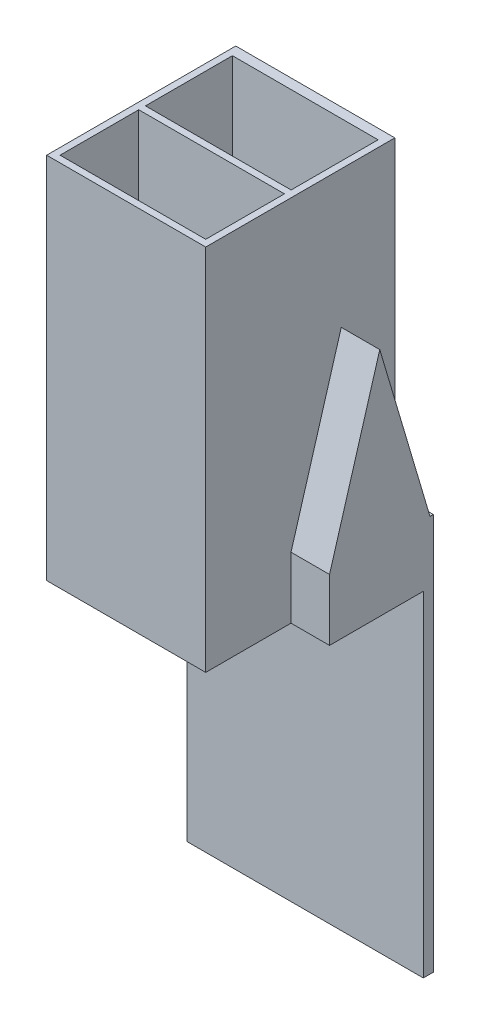
ISO-10303-21;
HEADER;
FILE_DESCRIPTION(('STEP AP214'),'2;1');
FILE_NAME('part.step','',(''),(''),'','','');
FILE_SCHEMA(('AUTOMOTIVE_DESIGN { 1 0 10303 214 1 1 1 1 }'));
ENDSEC;
DATA;
#1=APPLICATION_CONTEXT('core data for automotive mechanical design processes');
#2=APPLICATION_PROTOCOL_DEFINITION('international standard','automotive_design',2000,#1);
#3=PRODUCT_CONTEXT('',#1,'mechanical');
#4=PRODUCT('Part','Part','',(#3));
#5=PRODUCT_RELATED_PRODUCT_CATEGORY('part','',(#4));
#6=PRODUCT_DEFINITION_FORMATION('','',#4);
#7=PRODUCT_DEFINITION_CONTEXT('part definition',#1,'design');
#8=PRODUCT_DEFINITION('design','',#6,#7);
#9=PRODUCT_DEFINITION_SHAPE('','',#8);
#10=(LENGTH_UNIT() NAMED_UNIT(*) SI_UNIT(.MILLI.,.METRE.));
#11=(NAMED_UNIT(*) PLANE_ANGLE_UNIT() SI_UNIT($,.RADIAN.));
#12=(NAMED_UNIT(*) SI_UNIT($,.STERADIAN.) SOLID_ANGLE_UNIT());
#13=UNCERTAINTY_MEASURE_WITH_UNIT(LENGTH_MEASURE(1.E-05),#10,'distance_accuracy_value','');
#14=(GEOMETRIC_REPRESENTATION_CONTEXT(3) GLOBAL_UNCERTAINTY_ASSIGNED_CONTEXT((#13)) GLOBAL_UNIT_ASSIGNED_CONTEXT((#10,
#11,#12)) REPRESENTATION_CONTEXT('',''));
#15=CARTESIAN_POINT('',(0.,0.,0.));
#16=DIRECTION('',(0.,0.,1.));
#17=DIRECTION('',(1.,0.,0.));
#18=AXIS2_PLACEMENT_3D('',#15,#16,#17);
#19=CARTESIAN_POINT('',(0.399999999999999,22.,-5.5));
#20=DIRECTION('',(1.,0.,0.));
#21=DIRECTION('',(0.,0.,-1.));
#22=AXIS2_PLACEMENT_3D('',#19,#20,#21);
#23=PLANE('',#22);
#24=DIRECTION('',(0.,0.958836299508465,0.283959417426001));
#25=VECTOR('',#24,1.);
#26=CARTESIAN_POINT('',(0.399999999999999,21.931223694982,-5.26776534338938));
#27=LINE('',#26,#25);
#28=CARTESIAN_POINT('',(0.399999999999999,3.61201467116017,-10.693));
#29=VERTEX_POINT('',#28);
#30=CARTESIAN_POINT('',(0.399999999999999,12.3913480044935,-8.093));
#31=VERTEX_POINT('',#30);
#32=EDGE_CURVE('E424',#29,#31,#27,.T.);
#33=ORIENTED_EDGE('',*,*,#32,.F.);
#34=DIRECTION('',(0.,-1.,0.));
#35=VECTOR('',#34,1.);
#36=CARTESIAN_POINT('',(0.4,22.,-10.693));
#37=LINE('',#36,#35);
#38=CARTESIAN_POINT('',(0.4,22.,-10.693));
#39=VERTEX_POINT('',#38);
#40=EDGE_CURVE('E521',#39,#29,#37,.T.);
#41=ORIENTED_EDGE('',*,*,#40,.F.);
#42=DIRECTION('',(0.,0.,1.));
#43=VECTOR('',#42,1.);
#44=CARTESIAN_POINT('',(0.399999999999999,22.,-5.5));
#45=LINE('',#44,#43);
#46=CARTESIAN_POINT('',(0.399999999999999,22.,-5.5));
#47=VERTEX_POINT('',#46);
#48=EDGE_CURVE('E508',#39,#47,#45,.T.);
#49=ORIENTED_EDGE('',*,*,#48,.T.);
#50=DIRECTION('',(0.,-1.,0.));
#51=VECTOR('',#50,1.);
#52=CARTESIAN_POINT('',(0.399999999999999,22.,-5.5));
#53=LINE('',#52,#51);
#54=CARTESIAN_POINT('',(0.399999999999999,3.63565133782683,-5.5));
#55=VERTEX_POINT('',#54);
#56=EDGE_CURVE('E535',#47,#55,#53,.T.);
#57=ORIENTED_EDGE('',*,*,#56,.T.);
#58=DIRECTION('',(0.,-0.958836299508465,0.283959417426001));
#59=VECTOR('',#58,1.);
#60=CARTESIAN_POINT('',(0.4,20.5192283788606,-10.5000721740475));
#61=LINE('',#60,#59);
#62=EDGE_CURVE('E418',#31,#55,#61,.T.);
#63=ORIENTED_EDGE('',*,*,#62,.F.);
#64=EDGE_LOOP('',(#33,#41,#49,#57,#63));
#65=FACE_BOUND('',#64,.T.);
#66=ADVANCED_FACE('F39',(#65),#23,.T.);
#67=CARTESIAN_POINT('',(9.1,22.,-5.5));
#68=DIRECTION('',(0.,0.,-1.));
#69=DIRECTION('',(-1.,0.,0.));
#70=AXIS2_PLACEMENT_3D('',#67,#68,#69);
#71=PLANE('',#70);
#72=DIRECTION('',(1.,0.,0.));
#73=VECTOR('',#72,1.);
#74=CARTESIAN_POINT('',(9.10000000000001,3.63565133782683,-5.5));
#75=LINE('',#74,#73);
#76=CARTESIAN_POINT('',(9.1,3.63565133782684,-5.5));
#77=VERTEX_POINT('',#76);
#78=EDGE_CURVE('E415',#55,#77,#75,.T.);
#79=ORIENTED_EDGE('',*,*,#78,.F.);
#80=ORIENTED_EDGE('',*,*,#56,.F.);
#81=DIRECTION('',(1.,0.,0.));
#82=VECTOR('',#81,1.);
#83=CARTESIAN_POINT('',(9.1,22.,-5.5));
#84=LINE('',#83,#82);
#85=CARTESIAN_POINT('',(9.1,22.,-5.5));
#86=VERTEX_POINT('',#85);
#87=EDGE_CURVE('E511',#47,#86,#84,.T.);
#88=ORIENTED_EDGE('',*,*,#87,.T.);
#89=DIRECTION('',(0.,-1.,0.));
#90=VECTOR('',#89,1.);
#91=CARTESIAN_POINT('',(9.1,22.,-5.5));
#92=LINE('',#91,#90);
#93=EDGE_CURVE('E531',#86,#77,#92,.T.);
#94=ORIENTED_EDGE('',*,*,#93,.T.);
#95=EDGE_LOOP('',(#79,#80,#88,#94));
#96=FACE_BOUND('',#95,.T.);
#97=ADVANCED_FACE('F720',(#96),#71,.T.);
#98=CARTESIAN_POINT('',(9.1,22.,-5.5));
#99=DIRECTION('',(-1.,0.,0.));
#100=DIRECTION('',(0.,0.,1.));
#101=AXIS2_PLACEMENT_3D('',#98,#99,#100);
#102=PLANE('',#101);
#103=DIRECTION('',(0.,-0.958836299508465,-0.283959417426001));
#104=VECTOR('',#103,1.);
#105=CARTESIAN_POINT('',(9.1,21.931223694982,-5.26776534338938));
#106=LINE('',#105,#104);
#107=CARTESIAN_POINT('',(9.1,12.3913480044935,-8.093));
#108=VERTEX_POINT('',#107);
#109=CARTESIAN_POINT('',(9.1,3.61201467116017,-10.693));
#110=VERTEX_POINT('',#109);
#111=EDGE_CURVE('E421',#108,#110,#106,.T.);
#112=ORIENTED_EDGE('',*,*,#111,.F.);
#113=DIRECTION('',(0.,0.958836299508465,-0.283959417426001));
#114=VECTOR('',#113,1.);
#115=CARTESIAN_POINT('',(9.1,20.5192283788606,-10.5000721740475));
#116=LINE('',#115,#114);
#117=EDGE_CURVE('E412',#77,#108,#116,.T.);
#118=ORIENTED_EDGE('',*,*,#117,.F.);
#119=ORIENTED_EDGE('',*,*,#93,.F.);
#120=DIRECTION('',(0.,0.,-1.));
#121=VECTOR('',#120,1.);
#122=CARTESIAN_POINT('',(9.1,22.,-5.5));
#123=LINE('',#122,#121);
#124=CARTESIAN_POINT('',(9.1,22.,-10.693));
#125=VERTEX_POINT('',#124);
#126=EDGE_CURVE('E514',#86,#125,#123,.T.);
#127=ORIENTED_EDGE('',*,*,#126,.T.);
#128=DIRECTION('',(0.,-1.,0.));
#129=VECTOR('',#128,1.);
#130=CARTESIAN_POINT('',(9.1,22.,-10.693));
#131=LINE('',#130,#129);
#132=EDGE_CURVE('E527',#125,#110,#131,.T.);
#133=ORIENTED_EDGE('',*,*,#132,.T.);
#134=EDGE_LOOP('',(#112,#118,#119,#127,#133));
#135=FACE_BOUND('',#134,.T.);
#136=ADVANCED_FACE('F675',(#135),#102,.T.);
#137=CARTESIAN_POINT('',(0.,22.,0.));
#138=DIRECTION('',(1.,0.,0.));
#139=DIRECTION('',(0.,0.,-1.));
#140=AXIS2_PLACEMENT_3D('',#137,#138,#139);
#141=PLANE('',#140);
#142=DIRECTION('',(0.,-0.958836299508464,-0.283959417426001));
#143=VECTOR('',#142,1.);
#144=CARTESIAN_POINT('',(0.,3.67,-11.093));
#145=LINE('',#144,#143);
#146=CARTESIAN_POINT('',(0.,13.8,-8.093));
#147=VERTEX_POINT('',#146);
#148=CARTESIAN_POINT('',(0.,3.66999999999995,-11.093));
#149=VERTEX_POINT('',#148);
#150=EDGE_CURVE('E472',#147,#149,#145,.T.);
#151=ORIENTED_EDGE('',*,*,#150,.F.);
#152=DIRECTION('',(0.,0.958836299508464,-0.283959417426001));
#153=VECTOR('',#152,1.);
#154=CARTESIAN_POINT('',(0.,13.8,-8.093));
#155=LINE('',#154,#153);
#156=CARTESIAN_POINT('',(0.,3.67,-5.093));
#157=VERTEX_POINT('',#156);
#158=EDGE_CURVE('E486',#157,#147,#155,.T.);
#159=ORIENTED_EDGE('',*,*,#158,.F.);
#160=DIRECTION('',(0.,1.,0.));
#161=VECTOR('',#160,1.);
#162=CARTESIAN_POINT('',(0.,3.67,-5.093));
#163=LINE('',#162,#161);
#164=CARTESIAN_POINT('',(0.,0.,-5.093));
#165=VERTEX_POINT('',#164);
#166=EDGE_CURVE('E467',#165,#157,#163,.T.);
#167=ORIENTED_EDGE('',*,*,#166,.F.);
#168=DIRECTION('',(0.,0.,1.));
#169=VECTOR('',#168,1.);
#170=CARTESIAN_POINT('',(0.,0.,0.));
#171=LINE('',#170,#169);
#172=CARTESIAN_POINT('',(0.,0.,0.));
#173=VERTEX_POINT('',#172);
#174=EDGE_CURVE('E582',#165,#173,#171,.T.);
#175=ORIENTED_EDGE('',*,*,#174,.T.);
#176=DIRECTION('',(0.,-1.,0.));
#177=VECTOR('',#176,1.);
#178=CARTESIAN_POINT('',(0.,22.,0.));
#179=LINE('',#178,#177);
#180=CARTESIAN_POINT('',(0.,22.,0.));
#181=VERTEX_POINT('',#180);
#182=EDGE_CURVE('E43',#181,#173,#179,.T.);
#183=ORIENTED_EDGE('',*,*,#182,.F.);
#184=DIRECTION('',(0.,0.,1.));
#185=VECTOR('',#184,1.);
#186=CARTESIAN_POINT('',(0.,22.,0.));
#187=LINE('',#186,#185);
#188=CARTESIAN_POINT('',(0.,22.,-11.293));
#189=VERTEX_POINT('',#188);
#190=EDGE_CURVE('E583',#189,#181,#187,.T.);
#191=ORIENTED_EDGE('',*,*,#190,.F.);
#192=DIRECTION('',(0.,1.,0.));
#193=VECTOR('',#192,1.);
#194=CARTESIAN_POINT('',(0.,22.,-11.293));
#195=LINE('',#194,#193);
#196=CARTESIAN_POINT('',(0.,3.66999999999995,-11.293));
#197=VERTEX_POINT('',#196);
#198=EDGE_CURVE('E293',#197,#189,#195,.T.);
#199=ORIENTED_EDGE('',*,*,#198,.F.);
#200=DIRECTION('',(0.,0.,1.));
#201=VECTOR('',#200,1.);
#202=CARTESIAN_POINT('',(0.,3.66999999999995,-11.293));
#203=LINE('',#202,#201);
#204=EDGE_CURVE('E312',#197,#149,#203,.T.);
#205=ORIENTED_EDGE('',*,*,#204,.T.);
#206=EDGE_LOOP('',(#151,#159,#167,#175,#183,#191,#199,#205));
#207=FACE_BOUND('',#206,.T.);
#208=ADVANCED_FACE('F41',(#207),#141,.F.);
#209=CARTESIAN_POINT('',(0.,22.,0.));
#210=DIRECTION('',(0.,-1.,0.));
#211=DIRECTION('',(0.,0.,-1.));
#212=AXIS2_PLACEMENT_3D('',#209,#210,#211);
#213=PLANE('',#212);
#214=DIRECTION('',(1.,0.,0.));
#215=VECTOR('',#214,1.);
#216=CARTESIAN_POINT('',(0.4,22.,-0.4));
#217=LINE('',#216,#215);
#218=CARTESIAN_POINT('',(0.4,22.,-0.4));
#219=VERTEX_POINT('',#218);
#220=CARTESIAN_POINT('',(9.1,22.,-0.4));
#221=VERTEX_POINT('',#220);
#222=EDGE_CURVE('E540',#219,#221,#217,.T.);
#223=ORIENTED_EDGE('',*,*,#222,.F.);
#224=DIRECTION('',(0.,0.,1.));
#225=VECTOR('',#224,1.);
#226=CARTESIAN_POINT('',(0.4,22.,-0.4));
#227=LINE('',#226,#225);
#228=CARTESIAN_POINT('',(0.4,22.,-5.1));
#229=VERTEX_POINT('',#228);
#230=EDGE_CURVE('E551',#229,#219,#227,.T.);
#231=ORIENTED_EDGE('',*,*,#230,.F.);
#232=DIRECTION('',(-1.,0.,0.));
#233=VECTOR('',#232,1.);
#234=CARTESIAN_POINT('',(0.4,22.,-5.1));
#235=LINE('',#234,#233);
#236=CARTESIAN_POINT('',(9.1,22.,-5.1));
#237=VERTEX_POINT('',#236);
#238=EDGE_CURVE('E547',#237,#229,#235,.T.);
#239=ORIENTED_EDGE('',*,*,#238,.F.);
#240=DIRECTION('',(0.,0.,-1.));
#241=VECTOR('',#240,1.);
#242=CARTESIAN_POINT('',(9.1,22.,-0.4));
#243=LINE('',#242,#241);
#244=EDGE_CURVE('E543',#221,#237,#243,.T.);
#245=ORIENTED_EDGE('',*,*,#244,.F.);
#246=EDGE_LOOP('',(#223,#231,#239,#245));
#247=FACE_BOUND('',#246,.T.);
#248=ORIENTED_EDGE('',*,*,#190,.T.);
#249=DIRECTION('',(1.,0.,0.));
#250=VECTOR('',#249,1.);
#251=CARTESIAN_POINT('',(0.,22.,0.));
#252=LINE('',#251,#250);
#253=CARTESIAN_POINT('',(9.5,22.,0.));
#254=VERTEX_POINT('',#253);
#255=EDGE_CURVE('E587',#181,#254,#252,.T.);
#256=ORIENTED_EDGE('',*,*,#255,.T.);
#257=DIRECTION('',(0.,0.,-1.));
#258=VECTOR('',#257,1.);
#259=CARTESIAN_POINT('',(9.5,22.,0.));
#260=LINE('',#259,#258);
#261=CARTESIAN_POINT('',(9.5,22.,-11.293));
#262=VERTEX_POINT('',#261);
#263=EDGE_CURVE('E591',#254,#262,#260,.T.);
#264=ORIENTED_EDGE('',*,*,#263,.T.);
#265=DIRECTION('',(1.,0.,0.));
#266=VECTOR('',#265,1.);
#267=CARTESIAN_POINT('',(9.5,22.,-11.293));
#268=LINE('',#267,#266);
#269=EDGE_CURVE('E297',#189,#262,#268,.T.);
#270=ORIENTED_EDGE('',*,*,#269,.F.);
#271=EDGE_LOOP('',(#248,#256,#264,#270));
#272=FACE_BOUND('',#271,.T.);
#273=ORIENTED_EDGE('',*,*,#48,.F.);
#274=DIRECTION('',(-1.,0.,0.));
#275=VECTOR('',#274,1.);
#276=CARTESIAN_POINT('',(0.4,22.,-10.693));
#277=LINE('',#276,#275);
#278=EDGE_CURVE('E518',#125,#39,#277,.T.);
#279=ORIENTED_EDGE('',*,*,#278,.F.);
#280=ORIENTED_EDGE('',*,*,#126,.F.);
#281=ORIENTED_EDGE('',*,*,#87,.F.);
#282=EDGE_LOOP('',(#273,#279,#280,#281));
#283=FACE_BOUND('',#282,.T.);
#284=ADVANCED_FACE('F683',(#247,#272,#283),#213,.F.);
#285=CARTESIAN_POINT('',(0.,0.,0.));
#286=DIRECTION('',(0.,-1.,0.));
#287=DIRECTION('',(0.,0.,-1.));
#288=AXIS2_PLACEMENT_3D('',#285,#286,#287);
#289=PLANE('',#288);
#290=DIRECTION('',(-1.,0.,0.));
#291=VECTOR('',#290,1.);
#292=CARTESIAN_POINT('',(-2.3,0.,-10.693));
#293=LINE('',#292,#291);
#294=CARTESIAN_POINT('',(11.8,0.,-10.693));
#295=VERTEX_POINT('',#294);
#296=CARTESIAN_POINT('',(11.4,0.,-10.693));
#297=VERTEX_POINT('',#296);
#298=EDGE_CURVE('E50',#295,#297,#293,.T.);
#299=ORIENTED_EDGE('',*,*,#298,.F.);
#300=DIRECTION('',(0.,0.,1.));
#301=VECTOR('',#300,1.);
#302=CARTESIAN_POINT('',(11.8,0.,-5.093));
#303=LINE('',#302,#301);
#304=CARTESIAN_POINT('',(11.8,0.,-5.093));
#305=VERTEX_POINT('',#304);
#306=EDGE_CURVE('E428',#295,#305,#303,.T.);
#307=ORIENTED_EDGE('',*,*,#306,.T.);
#308=DIRECTION('',(-1.,0.,0.));
#309=VECTOR('',#308,1.);
#310=CARTESIAN_POINT('',(11.8,0.,-5.093));
#311=LINE('',#310,#309);
#312=CARTESIAN_POINT('',(9.5,0.,-5.093));
#313=VERTEX_POINT('',#312);
#314=EDGE_CURVE('E444',#305,#313,#311,.T.);
#315=ORIENTED_EDGE('',*,*,#314,.T.);
#316=DIRECTION('',(0.,0.,-1.));
#317=VECTOR('',#316,1.);
#318=CARTESIAN_POINT('',(9.5,0.,0.));
#319=LINE('',#318,#317);
#320=CARTESIAN_POINT('',(9.5,0.,0.));
#321=VERTEX_POINT('',#320);
#322=EDGE_CURVE('E588',#321,#313,#319,.T.);
#323=ORIENTED_EDGE('',*,*,#322,.F.);
#324=DIRECTION('',(1.,0.,0.));
#325=VECTOR('',#324,1.);
#326=CARTESIAN_POINT('',(0.,0.,0.));
#327=LINE('',#326,#325);
#328=EDGE_CURVE('E597',#173,#321,#327,.T.);
#329=ORIENTED_EDGE('',*,*,#328,.F.);
#330=ORIENTED_EDGE('',*,*,#174,.F.);
#331=DIRECTION('',(1.,0.,0.));
#332=VECTOR('',#331,1.);
#333=CARTESIAN_POINT('',(-2.3,0.,-5.093));
#334=LINE('',#333,#332);
#335=CARTESIAN_POINT('',(-2.3,0.,-5.093));
#336=VERTEX_POINT('',#335);
#337=EDGE_CURVE('E503',#336,#165,#334,.T.);
#338=ORIENTED_EDGE('',*,*,#337,.F.);
#339=DIRECTION('',(0.,0.,1.));
#340=VECTOR('',#339,1.);
#341=CARTESIAN_POINT('',(-2.3,0.,-5.093));
#342=LINE('',#341,#340);
#343=CARTESIAN_POINT('',(-2.3,0.,-10.693));
#344=VERTEX_POINT('',#343);
#345=EDGE_CURVE('E468',#344,#336,#342,.T.);
#346=ORIENTED_EDGE('',*,*,#345,.F.);
#347=CARTESIAN_POINT('',(-1.9,0.,-10.693));
#348=VERTEX_POINT('',#347);
#349=EDGE_CURVE('E11',#348,#344,#293,.T.);
#350=ORIENTED_EDGE('',*,*,#349,.F.);
#351=DIRECTION('',(0.,0.,-1.));
#352=VECTOR('',#351,1.);
#353=CARTESIAN_POINT('',(-1.9,0.,-5.5));
#354=LINE('',#353,#352);
#355=CARTESIAN_POINT('',(-1.9,0.,-5.5));
#356=VERTEX_POINT('',#355);
#357=EDGE_CURVE('E330',#356,#348,#354,.T.);
#358=ORIENTED_EDGE('',*,*,#357,.F.);
#359=DIRECTION('',(1.,0.,0.));
#360=VECTOR('',#359,1.);
#361=CARTESIAN_POINT('',(9.1,0.,-5.5));
#362=LINE('',#361,#360);
#363=CARTESIAN_POINT('',(11.4,0.,-5.5));
#364=VERTEX_POINT('',#363);
#365=EDGE_CURVE('E507',#356,#364,#362,.T.);
#366=ORIENTED_EDGE('',*,*,#365,.T.);
#367=DIRECTION('',(0.,0.,1.));
#368=VECTOR('',#367,1.);
#369=CARTESIAN_POINT('',(11.4,0.,-5.5));
#370=LINE('',#369,#368);
#371=EDGE_CURVE('E336',#297,#364,#370,.T.);
#372=ORIENTED_EDGE('',*,*,#371,.F.);
#373=EDGE_LOOP('',(#299,#307,#315,#323,#329,#330,#338,#346,#350,#358,#366,#372));
#374=FACE_BOUND('',#373,.T.);
#375=DIRECTION('',(0.,0.,1.));
#376=VECTOR('',#375,1.);
#377=CARTESIAN_POINT('',(0.4,0.,-0.4));
#378=LINE('',#377,#376);
#379=CARTESIAN_POINT('',(0.4,0.,-5.1));
#380=VERTEX_POINT('',#379);
#381=CARTESIAN_POINT('',(0.4,0.,-0.4));
#382=VERTEX_POINT('',#381);
#383=EDGE_CURVE('E544',#380,#382,#378,.T.);
#384=ORIENTED_EDGE('',*,*,#383,.T.);
#385=DIRECTION('',(1.,0.,0.));
#386=VECTOR('',#385,1.);
#387=CARTESIAN_POINT('',(0.4,0.,-0.4));
#388=LINE('',#387,#386);
#389=CARTESIAN_POINT('',(9.1,0.,-0.4));
#390=VERTEX_POINT('',#389);
#391=EDGE_CURVE('E539',#382,#390,#388,.T.);
#392=ORIENTED_EDGE('',*,*,#391,.T.);
#393=DIRECTION('',(0.,0.,-1.));
#394=VECTOR('',#393,1.);
#395=CARTESIAN_POINT('',(9.1,0.,-0.4));
#396=LINE('',#395,#394);
#397=CARTESIAN_POINT('',(9.1,0.,-5.1));
#398=VERTEX_POINT('',#397);
#399=EDGE_CURVE('E558',#390,#398,#396,.T.);
#400=ORIENTED_EDGE('',*,*,#399,.T.);
#401=DIRECTION('',(-1.,0.,0.));
#402=VECTOR('',#401,1.);
#403=CARTESIAN_POINT('',(0.4,0.,-5.1));
#404=LINE('',#403,#402);
#405=EDGE_CURVE('E562',#398,#380,#404,.T.);
#406=ORIENTED_EDGE('',*,*,#405,.T.);
#407=EDGE_LOOP('',(#384,#392,#400,#406));
#408=FACE_BOUND('',#407,.T.);
#409=ADVANCED_FACE('F618',(#374,#408),#289,.T.);
#410=CARTESIAN_POINT('',(0.,22.,0.));
#411=DIRECTION('',(0.,0.,-1.));
#412=DIRECTION('',(-1.,0.,0.));
#413=AXIS2_PLACEMENT_3D('',#410,#411,#412);
#414=PLANE('',#413);
#415=ORIENTED_EDGE('',*,*,#328,.T.);
#416=DIRECTION('',(0.,-1.,0.));
#417=VECTOR('',#416,1.);
#418=CARTESIAN_POINT('',(9.5,22.,0.));
#419=LINE('',#418,#417);
#420=EDGE_CURVE('E594',#254,#321,#419,.T.);
#421=ORIENTED_EDGE('',*,*,#420,.F.);
#422=ORIENTED_EDGE('',*,*,#255,.F.);
#423=ORIENTED_EDGE('',*,*,#182,.T.);
#424=EDGE_LOOP('',(#415,#421,#422,#423));
#425=FACE_BOUND('',#424,.T.);
#426=ADVANCED_FACE('F612',(#425),#414,.F.);
#427=CARTESIAN_POINT('',(9.5,22.,0.));
#428=DIRECTION('',(-1.,0.,0.));
#429=DIRECTION('',(0.,0.,1.));
#430=AXIS2_PLACEMENT_3D('',#427,#428,#429);
#431=PLANE('',#430);
#432=ORIENTED_EDGE('',*,*,#322,.T.);
#433=DIRECTION('',(0.,1.,0.));
#434=VECTOR('',#433,1.);
#435=CARTESIAN_POINT('',(9.5,3.67,-5.093));
#436=LINE('',#435,#434);
#437=CARTESIAN_POINT('',(9.5,3.67,-5.093));
#438=VERTEX_POINT('',#437);
#439=EDGE_CURVE('E432',#313,#438,#436,.T.);
#440=ORIENTED_EDGE('',*,*,#439,.T.);
#441=DIRECTION('',(0.,0.958836299508464,-0.283959417426001));
#442=VECTOR('',#441,1.);
#443=CARTESIAN_POINT('',(9.5,13.8,-8.093));
#444=LINE('',#443,#442);
#445=CARTESIAN_POINT('',(9.5,13.8,-8.093));
#446=VERTEX_POINT('',#445);
#447=EDGE_CURVE('E448',#438,#446,#444,.T.);
#448=ORIENTED_EDGE('',*,*,#447,.T.);
#449=DIRECTION('',(0.,-0.958836299508464,-0.283959417426001));
#450=VECTOR('',#449,1.);
#451=CARTESIAN_POINT('',(9.5,3.67,-11.093));
#452=LINE('',#451,#450);
#453=CARTESIAN_POINT('',(9.5,3.66999999999995,-11.093));
#454=VERTEX_POINT('',#453);
#455=EDGE_CURVE('E427',#446,#454,#452,.T.);
#456=ORIENTED_EDGE('',*,*,#455,.T.);
#457=DIRECTION('',(0.,0.,1.));
#458=VECTOR('',#457,1.);
#459=CARTESIAN_POINT('',(9.5,3.66999999999995,-11.293));
#460=LINE('',#459,#458);
#461=CARTESIAN_POINT('',(9.5,3.66999999999995,-11.293));
#462=VERTEX_POINT('',#461);
#463=EDGE_CURVE('E309',#462,#454,#460,.T.);
#464=ORIENTED_EDGE('',*,*,#463,.F.);
#465=DIRECTION('',(0.,-1.,0.));
#466=VECTOR('',#465,1.);
#467=CARTESIAN_POINT('',(9.5,22.,-11.293));
#468=LINE('',#467,#466);
#469=EDGE_CURVE('E301',#262,#462,#468,.T.);
#470=ORIENTED_EDGE('',*,*,#469,.F.);
#471=ORIENTED_EDGE('',*,*,#263,.F.);
#472=ORIENTED_EDGE('',*,*,#420,.T.);
#473=EDGE_LOOP('',(#432,#440,#448,#456,#464,#470,#471,#472));
#474=FACE_BOUND('',#473,.T.);
#475=ADVANCED_FACE('F622',(#474),#431,.F.);
#476=CARTESIAN_POINT('',(0.4,22.,-0.4));
#477=DIRECTION('',(0.,0.,-1.));
#478=DIRECTION('',(-1.,0.,0.));
#479=AXIS2_PLACEMENT_3D('',#476,#477,#478);
#480=PLANE('',#479);
#481=ORIENTED_EDGE('',*,*,#391,.F.);
#482=DIRECTION('',(0.,-1.,0.));
#483=VECTOR('',#482,1.);
#484=CARTESIAN_POINT('',(0.4,22.,-0.4));
#485=LINE('',#484,#483);
#486=EDGE_CURVE('E554',#219,#382,#485,.T.);
#487=ORIENTED_EDGE('',*,*,#486,.F.);
#488=ORIENTED_EDGE('',*,*,#222,.T.);
#489=DIRECTION('',(0.,-1.,0.));
#490=VECTOR('',#489,1.);
#491=CARTESIAN_POINT('',(9.1,22.,-0.4));
#492=LINE('',#491,#490);
#493=EDGE_CURVE('E578',#221,#390,#492,.T.);
#494=ORIENTED_EDGE('',*,*,#493,.T.);
#495=EDGE_LOOP('',(#481,#487,#488,#494));
#496=FACE_BOUND('',#495,.T.);
#497=ADVANCED_FACE('F740',(#496),#480,.T.);
#498=CARTESIAN_POINT('',(9.1,22.,-0.4));
#499=DIRECTION('',(-1.,0.,0.));
#500=DIRECTION('',(0.,0.,1.));
#501=AXIS2_PLACEMENT_3D('',#498,#499,#500);
#502=PLANE('',#501);
#503=ORIENTED_EDGE('',*,*,#399,.F.);
#504=ORIENTED_EDGE('',*,*,#493,.F.);
#505=ORIENTED_EDGE('',*,*,#244,.T.);
#506=DIRECTION('',(0.,-1.,0.));
#507=VECTOR('',#506,1.);
#508=CARTESIAN_POINT('',(9.1,22.,-5.1));
#509=LINE('',#508,#507);
#510=EDGE_CURVE('E575',#237,#398,#509,.T.);
#511=ORIENTED_EDGE('',*,*,#510,.T.);
#512=EDGE_LOOP('',(#503,#504,#505,#511));
#513=FACE_BOUND('',#512,.T.);
#514=ADVANCED_FACE('F736',(#513),#502,.T.);
#515=CARTESIAN_POINT('',(0.4,22.,-5.1));
#516=DIRECTION('',(0.,0.,1.));
#517=DIRECTION('',(1.,0.,0.));
#518=AXIS2_PLACEMENT_3D('',#515,#516,#517);
#519=PLANE('',#518);
#520=ORIENTED_EDGE('',*,*,#405,.F.);
#521=ORIENTED_EDGE('',*,*,#510,.F.);
#522=ORIENTED_EDGE('',*,*,#238,.T.);
#523=DIRECTION('',(0.,-1.,0.));
#524=VECTOR('',#523,1.);
#525=CARTESIAN_POINT('',(0.4,22.,-5.1));
#526=LINE('',#525,#524);
#527=EDGE_CURVE('E572',#229,#380,#526,.T.);
#528=ORIENTED_EDGE('',*,*,#527,.T.);
#529=EDGE_LOOP('',(#520,#521,#522,#528));
#530=FACE_BOUND('',#529,.T.);
#531=ADVANCED_FACE('F732',(#530),#519,.T.);
#532=CARTESIAN_POINT('',(0.4,22.,-0.4));
#533=DIRECTION('',(1.,0.,0.));
#534=DIRECTION('',(0.,0.,-1.));
#535=AXIS2_PLACEMENT_3D('',#532,#533,#534);
#536=PLANE('',#535);
#537=ORIENTED_EDGE('',*,*,#383,.F.);
#538=ORIENTED_EDGE('',*,*,#527,.F.);
#539=ORIENTED_EDGE('',*,*,#230,.T.);
#540=ORIENTED_EDGE('',*,*,#486,.T.);
#541=EDGE_LOOP('',(#537,#538,#539,#540));
#542=FACE_BOUND('',#541,.T.);
#543=ADVANCED_FACE('F729',(#542),#536,.T.);
#544=DIRECTION('',(-1.,0.,0.));
#545=VECTOR('',#544,1.);
#546=CARTESIAN_POINT('',(9.1,0.400000000000001,-5.5));
#547=LINE('',#546,#545);
#548=CARTESIAN_POINT('',(11.4,0.4,-5.5));
#549=VERTEX_POINT('',#548);
#550=CARTESIAN_POINT('',(-1.9,0.4,-5.5));
#551=VERTEX_POINT('',#550);
#552=EDGE_CURVE('E64',#549,#551,#547,.T.);
#553=ORIENTED_EDGE('',*,*,#552,.F.);
#554=DIRECTION('',(0.,-1.,0.));
#555=VECTOR('',#554,1.);
#556=CARTESIAN_POINT('',(11.4,0.4,-5.5));
#557=LINE('',#556,#555);
#558=EDGE_CURVE('E348',#549,#364,#557,.T.);
#559=ORIENTED_EDGE('',*,*,#558,.T.);
#560=ORIENTED_EDGE('',*,*,#365,.F.);
#561=DIRECTION('',(0.,-1.,0.));
#562=VECTOR('',#561,1.);
#563=CARTESIAN_POINT('',(-1.9,0.4,-5.5));
#564=LINE('',#563,#562);
#565=EDGE_CURVE('E343',#551,#356,#564,.T.);
#566=ORIENTED_EDGE('',*,*,#565,.F.);
#567=EDGE_LOOP('',(#553,#559,#560,#566));
#568=FACE_BOUND('',#567,.T.);
#569=ADVANCED_FACE('F667',(#568),#71,.T.);
#570=CARTESIAN_POINT('',(0.4,22.,-10.693));
#571=DIRECTION('',(0.,0.,1.));
#572=DIRECTION('',(1.,0.,0.));
#573=AXIS2_PLACEMENT_3D('',#570,#571,#572);
#574=PLANE('',#573);
#575=DIRECTION('',(0.,-1.,0.));
#576=VECTOR('',#575,1.);
#577=CARTESIAN_POINT('',(-1.9,0.4,-10.693));
#578=LINE('',#577,#576);
#579=CARTESIAN_POINT('',(-1.9,0.4,-10.693));
#580=VERTEX_POINT('',#579);
#581=EDGE_CURVE('E335',#580,#348,#578,.T.);
#582=ORIENTED_EDGE('',*,*,#581,.T.);
#583=ORIENTED_EDGE('',*,*,#349,.T.);
#584=DIRECTION('',(0.,1.,0.));
#585=VECTOR('',#584,1.);
#586=CARTESIAN_POINT('',(-2.3,-20.,-10.693));
#587=LINE('',#586,#585);
#588=CARTESIAN_POINT('',(-2.3,-20.,-10.693));
#589=VERTEX_POINT('',#588);
#590=EDGE_CURVE('E322',#589,#344,#587,.T.);
#591=ORIENTED_EDGE('',*,*,#590,.F.);
#592=DIRECTION('',(-1.,0.,0.));
#593=VECTOR('',#592,1.);
#594=CARTESIAN_POINT('',(-2.3,-20.,-10.693));
#595=LINE('',#594,#593);
#596=CARTESIAN_POINT('',(11.8,-20.,-10.693));
#597=VERTEX_POINT('',#596);
#598=EDGE_CURVE('E269',#597,#589,#595,.T.);
#599=ORIENTED_EDGE('',*,*,#598,.F.);
#600=DIRECTION('',(0.,1.,0.));
#601=VECTOR('',#600,1.);
#602=CARTESIAN_POINT('',(11.8,-20.,-10.693));
#603=LINE('',#602,#601);
#604=EDGE_CURVE('E265',#597,#295,#603,.T.);
#605=ORIENTED_EDGE('',*,*,#604,.T.);
#606=ORIENTED_EDGE('',*,*,#298,.T.);
#607=DIRECTION('',(0.,-1.,0.));
#608=VECTOR('',#607,1.);
#609=CARTESIAN_POINT('',(11.4,3.61201467116017,-10.693));
#610=LINE('',#609,#608);
#611=CARTESIAN_POINT('',(11.4,3.61201467116017,-10.693));
#612=VERTEX_POINT('',#611);
#613=EDGE_CURVE('E354',#612,#297,#610,.T.);
#614=ORIENTED_EDGE('',*,*,#613,.F.);
#615=DIRECTION('',(-1.,0.,0.));
#616=VECTOR('',#615,1.);
#617=CARTESIAN_POINT('',(11.4,3.61201467116017,-10.693));
#618=LINE('',#617,#616);
#619=EDGE_CURVE('E392',#612,#110,#618,.T.);
#620=ORIENTED_EDGE('',*,*,#619,.T.);
#621=ORIENTED_EDGE('',*,*,#132,.F.);
#622=ORIENTED_EDGE('',*,*,#278,.T.);
#623=ORIENTED_EDGE('',*,*,#40,.T.);
#624=CARTESIAN_POINT('',(-2.3,3.61201467116017,-10.693));
#625=VERTEX_POINT('',#624);
#626=EDGE_CURVE('E396',#29,#625,#618,.T.);
#627=ORIENTED_EDGE('',*,*,#626,.T.);
#628=DIRECTION('',(0.,-1.,0.));
#629=VECTOR('',#628,1.);
#630=CARTESIAN_POINT('',(-2.3,3.61201467116017,-10.693));
#631=LINE('',#630,#629);
#632=CARTESIAN_POINT('',(-2.3,0.4,-10.693));
#633=VERTEX_POINT('',#632);
#634=EDGE_CURVE('E347',#625,#633,#631,.T.);
#635=ORIENTED_EDGE('',*,*,#634,.T.);
#636=DIRECTION('',(-1.,0.,0.));
#637=VECTOR('',#636,1.);
#638=CARTESIAN_POINT('',(11.4,0.4,-10.693));
#639=LINE('',#638,#637);
#640=EDGE_CURVE('E373',#580,#633,#639,.T.);
#641=ORIENTED_EDGE('',*,*,#640,.F.);
#642=EDGE_LOOP('',(#582,#583,#591,#599,#605,#606,#614,#620,#621,#622,#623,#627,#635,#641));
#643=FACE_BOUND('',#642,.T.);
#644=ADVANCED_FACE('F639',(#643),#574,.T.);
#645=CARTESIAN_POINT('',(-2.3,3.67,-5.093));
#646=DIRECTION('',(0.,0.,-1.));
#647=DIRECTION('',(0.,1.,0.));
#648=AXIS2_PLACEMENT_3D('',#645,#646,#647);
#649=PLANE('',#648);
#650=ORIENTED_EDGE('',*,*,#166,.T.);
#651=DIRECTION('',(1.,0.,0.));
#652=VECTOR('',#651,1.);
#653=CARTESIAN_POINT('',(-2.3,3.67,-5.093));
#654=LINE('',#653,#652);
#655=CARTESIAN_POINT('',(-2.3,3.67,-5.093));
#656=VERTEX_POINT('',#655);
#657=EDGE_CURVE('E499',#656,#157,#654,.T.);
#658=ORIENTED_EDGE('',*,*,#657,.F.);
#659=DIRECTION('',(0.,1.,0.));
#660=VECTOR('',#659,1.);
#661=CARTESIAN_POINT('',(-2.3,3.67,-5.093));
#662=LINE('',#661,#660);
#663=EDGE_CURVE('E471',#336,#656,#662,.T.);
#664=ORIENTED_EDGE('',*,*,#663,.F.);
#665=ORIENTED_EDGE('',*,*,#337,.T.);
#666=EDGE_LOOP('',(#650,#658,#664,#665));
#667=FACE_BOUND('',#666,.T.);
#668=ADVANCED_FACE('F660',(#667),#649,.F.);
#669=CARTESIAN_POINT('',(-2.3,13.8,-8.093));
#670=DIRECTION('',(0.,-0.283959417426001,-0.958836299508465));
#671=DIRECTION('',(0.,0.958836299508465,-0.283959417426001));
#672=AXIS2_PLACEMENT_3D('',#669,#670,#671);
#673=PLANE('',#672);
#674=ORIENTED_EDGE('',*,*,#158,.T.);
#675=DIRECTION('',(1.,0.,0.));
#676=VECTOR('',#675,1.);
#677=CARTESIAN_POINT('',(-2.3,13.8,-8.093));
#678=LINE('',#677,#676);
#679=CARTESIAN_POINT('',(-2.3,13.8,-8.093));
#680=VERTEX_POINT('',#679);
#681=EDGE_CURVE('E495',#680,#147,#678,.T.);
#682=ORIENTED_EDGE('',*,*,#681,.F.);
#683=DIRECTION('',(0.,0.958836299508464,-0.283959417426001));
#684=VECTOR('',#683,1.);
#685=CARTESIAN_POINT('',(-2.3,13.8,-8.093));
#686=LINE('',#685,#684);
#687=EDGE_CURVE('E475',#656,#680,#686,.T.);
#688=ORIENTED_EDGE('',*,*,#687,.F.);
#689=ORIENTED_EDGE('',*,*,#657,.T.);
#690=EDGE_LOOP('',(#674,#682,#688,#689));
#691=FACE_BOUND('',#690,.T.);
#692=ADVANCED_FACE('F657',(#691),#673,.F.);
#693=CARTESIAN_POINT('',(-2.3,3.67,-11.093));
#694=DIRECTION('',(0.,-0.283959417426001,0.958836299508465));
#695=DIRECTION('',(0.,-0.958836299508465,-0.283959417426001));
#696=AXIS2_PLACEMENT_3D('',#693,#694,#695);
#697=PLANE('',#696);
#698=ORIENTED_EDGE('',*,*,#150,.T.);
#699=DIRECTION('',(1.,0.,0.));
#700=VECTOR('',#699,1.);
#701=CARTESIAN_POINT('',(-2.3,3.67,-11.093));
#702=LINE('',#701,#700);
#703=CARTESIAN_POINT('',(-2.3,3.67,-11.093));
#704=VERTEX_POINT('',#703);
#705=EDGE_CURVE('E482',#704,#149,#702,.T.);
#706=ORIENTED_EDGE('',*,*,#705,.F.);
#707=DIRECTION('',(0.,-0.958836299508464,-0.283959417426001));
#708=VECTOR('',#707,1.);
#709=CARTESIAN_POINT('',(-2.3,3.67,-11.093));
#710=LINE('',#709,#708);
#711=EDGE_CURVE('E478',#680,#704,#710,.T.);
#712=ORIENTED_EDGE('',*,*,#711,.F.);
#713=ORIENTED_EDGE('',*,*,#681,.T.);
#714=EDGE_LOOP('',(#698,#706,#712,#713));
#715=FACE_BOUND('',#714,.T.);
#716=ADVANCED_FACE('F652',(#715),#697,.F.);
#717=CARTESIAN_POINT('',(-2.3,0.,0.));
#718=DIRECTION('',(1.,0.,0.));
#719=DIRECTION('',(0.,0.,-1.));
#720=AXIS2_PLACEMENT_3D('',#717,#718,#719);
#721=PLANE('',#720);
#722=DIRECTION('',(0.,0.,1.));
#723=VECTOR('',#722,1.);
#724=CARTESIAN_POINT('',(-2.3,0.4,-10.693));
#725=LINE('',#724,#723);
#726=CARTESIAN_POINT('',(-2.3,0.4,-5.493));
#727=VERTEX_POINT('',#726);
#728=EDGE_CURVE('E377',#633,#727,#725,.T.);
#729=ORIENTED_EDGE('',*,*,#728,.F.);
#730=ORIENTED_EDGE('',*,*,#634,.F.);
#731=DIRECTION('',(0.,-0.958836299508465,-0.283959417426001));
#732=VECTOR('',#731,1.);
#733=CARTESIAN_POINT('',(-2.3,12.3913480044935,-8.093));
#734=LINE('',#733,#732);
#735=CARTESIAN_POINT('',(-2.3,12.3913480044935,-8.093));
#736=VERTEX_POINT('',#735);
#737=EDGE_CURVE('E358',#736,#625,#734,.T.);
#738=ORIENTED_EDGE('',*,*,#737,.F.);
#739=DIRECTION('',(0.,0.958836299508464,-0.283959417426001));
#740=VECTOR('',#739,1.);
#741=CARTESIAN_POINT('',(-2.3,3.61201467116017,-5.493));
#742=LINE('',#741,#740);
#743=CARTESIAN_POINT('',(-2.3,3.61201467116017,-5.493));
#744=VERTEX_POINT('',#743);
#745=EDGE_CURVE('E385',#744,#736,#742,.T.);
#746=ORIENTED_EDGE('',*,*,#745,.F.);
#747=DIRECTION('',(0.,1.,0.));
#748=VECTOR('',#747,1.);
#749=CARTESIAN_POINT('',(-2.3,0.4,-5.493));
#750=LINE('',#749,#748);
#751=EDGE_CURVE('E381',#727,#744,#750,.T.);
#752=ORIENTED_EDGE('',*,*,#751,.F.);
#753=EDGE_LOOP('',(#729,#730,#738,#746,#752));
#754=FACE_BOUND('',#753,.T.);
#755=ORIENTED_EDGE('',*,*,#711,.T.);
#756=DIRECTION('',(0.,0.,1.));
#757=VECTOR('',#756,1.);
#758=CARTESIAN_POINT('',(-2.3,3.67,-11.293));
#759=LINE('',#758,#757);
#760=CARTESIAN_POINT('',(-2.3,3.67,-11.293));
#761=VERTEX_POINT('',#760);
#762=EDGE_CURVE('E316',#761,#704,#759,.T.);
#763=ORIENTED_EDGE('',*,*,#762,.F.);
#764=DIRECTION('',(0.,1.,0.));
#765=VECTOR('',#764,1.);
#766=CARTESIAN_POINT('',(-2.3,-20.,-11.293));
#767=LINE('',#766,#765);
#768=CARTESIAN_POINT('',(-2.3,-20.,-11.293));
#769=VERTEX_POINT('',#768);
#770=EDGE_CURVE('E279',#769,#761,#767,.T.);
#771=ORIENTED_EDGE('',*,*,#770,.F.);
#772=DIRECTION('',(0.,0.,-1.));
#773=VECTOR('',#772,1.);
#774=CARTESIAN_POINT('',(-2.3,-20.,-11.093));
#775=LINE('',#774,#773);
#776=EDGE_CURVE('E270',#589,#769,#775,.T.);
#777=ORIENTED_EDGE('',*,*,#776,.F.);
#778=ORIENTED_EDGE('',*,*,#590,.T.);
#779=ORIENTED_EDGE('',*,*,#345,.T.);
#780=ORIENTED_EDGE('',*,*,#663,.T.);
#781=ORIENTED_EDGE('',*,*,#687,.T.);
#782=EDGE_LOOP('',(#755,#763,#771,#777,#778,#779,#780,#781));
#783=FACE_BOUND('',#782,.T.);
#784=ADVANCED_FACE('F643',(#754,#783),#721,.F.);
#785=CARTESIAN_POINT('',(11.8,3.67,-11.093));
#786=DIRECTION('',(0.,0.283959417426001,-0.958836299508465));
#787=DIRECTION('',(0.,0.958836299508465,0.283959417426001));
#788=AXIS2_PLACEMENT_3D('',#785,#786,#787);
#789=PLANE('',#788);
#790=ORIENTED_EDGE('',*,*,#455,.F.);
#791=DIRECTION('',(-1.,0.,0.));
#792=VECTOR('',#791,1.);
#793=CARTESIAN_POINT('',(11.8,13.8,-8.093));
#794=LINE('',#793,#792);
#795=CARTESIAN_POINT('',(11.8,13.8,-8.093));
#796=VERTEX_POINT('',#795);
#797=EDGE_CURVE('E460',#796,#446,#794,.T.);
#798=ORIENTED_EDGE('',*,*,#797,.F.);
#799=DIRECTION('',(0.,-0.958836299508464,-0.283959417426001));
#800=VECTOR('',#799,1.);
#801=CARTESIAN_POINT('',(11.8,3.67,-11.093));
#802=LINE('',#801,#800);
#803=CARTESIAN_POINT('',(11.8,3.67,-11.093));
#804=VERTEX_POINT('',#803);
#805=EDGE_CURVE('E431',#796,#804,#802,.T.);
#806=ORIENTED_EDGE('',*,*,#805,.T.);
#807=DIRECTION('',(-1.,0.,0.));
#808=VECTOR('',#807,1.);
#809=CARTESIAN_POINT('',(11.8,3.67,-11.093));
#810=LINE('',#809,#808);
#811=EDGE_CURVE('E463',#804,#454,#810,.T.);
#812=ORIENTED_EDGE('',*,*,#811,.T.);
#813=EDGE_LOOP('',(#790,#798,#806,#812));
#814=FACE_BOUND('',#813,.T.);
#815=ADVANCED_FACE('F633',(#814),#789,.T.);
#816=CARTESIAN_POINT('',(11.8,13.8,-8.093));
#817=DIRECTION('',(0.,0.283959417426001,0.958836299508465));
#818=DIRECTION('',(0.,-0.958836299508465,0.283959417426001));
#819=AXIS2_PLACEMENT_3D('',#816,#817,#818);
#820=PLANE('',#819);
#821=ORIENTED_EDGE('',*,*,#447,.F.);
#822=DIRECTION('',(-1.,0.,0.));
#823=VECTOR('',#822,1.);
#824=CARTESIAN_POINT('',(11.8,3.67,-5.093));
#825=LINE('',#824,#823);
#826=CARTESIAN_POINT('',(11.8,3.67,-5.093));
#827=VERTEX_POINT('',#826);
#828=EDGE_CURVE('E457',#827,#438,#825,.T.);
#829=ORIENTED_EDGE('',*,*,#828,.F.);
#830=DIRECTION('',(0.,0.958836299508464,-0.283959417426001));
#831=VECTOR('',#830,1.);
#832=CARTESIAN_POINT('',(11.8,13.8,-8.093));
#833=LINE('',#832,#831);
#834=EDGE_CURVE('E436',#827,#796,#833,.T.);
#835=ORIENTED_EDGE('',*,*,#834,.T.);
#836=ORIENTED_EDGE('',*,*,#797,.T.);
#837=EDGE_LOOP('',(#821,#829,#835,#836));
#838=FACE_BOUND('',#837,.T.);
#839=ADVANCED_FACE('F629',(#838),#820,.T.);
#840=CARTESIAN_POINT('',(11.8,3.67,-5.093));
#841=DIRECTION('',(0.,0.,1.));
#842=DIRECTION('',(0.,-1.,0.));
#843=AXIS2_PLACEMENT_3D('',#840,#841,#842);
#844=PLANE('',#843);
#845=ORIENTED_EDGE('',*,*,#439,.F.);
#846=ORIENTED_EDGE('',*,*,#314,.F.);
#847=DIRECTION('',(0.,1.,0.));
#848=VECTOR('',#847,1.);
#849=CARTESIAN_POINT('',(11.8,3.67,-5.093));
#850=LINE('',#849,#848);
#851=EDGE_CURVE('E440',#305,#827,#850,.T.);
#852=ORIENTED_EDGE('',*,*,#851,.T.);
#853=ORIENTED_EDGE('',*,*,#828,.T.);
#854=EDGE_LOOP('',(#845,#846,#852,#853));
#855=FACE_BOUND('',#854,.T.);
#856=ADVANCED_FACE('F625',(#855),#844,.T.);
#857=CARTESIAN_POINT('',(11.8,0.,0.));
#858=DIRECTION('',(-1.,0.,0.));
#859=DIRECTION('',(0.,0.,-1.));
#860=AXIS2_PLACEMENT_3D('',#857,#858,#859);
#861=PLANE('',#860);
#862=ORIENTED_EDGE('',*,*,#306,.F.);
#863=ORIENTED_EDGE('',*,*,#604,.F.);
#864=DIRECTION('',(0.,0.,1.));
#865=VECTOR('',#864,1.);
#866=CARTESIAN_POINT('',(11.8,-20.,-11.093));
#867=LINE('',#866,#865);
#868=CARTESIAN_POINT('',(11.8,-20.,-11.293));
#869=VERTEX_POINT('',#868);
#870=EDGE_CURVE('E258',#869,#597,#867,.T.);
#871=ORIENTED_EDGE('',*,*,#870,.F.);
#872=DIRECTION('',(0.,-1.,0.));
#873=VECTOR('',#872,1.);
#874=CARTESIAN_POINT('',(11.8,-20.,-11.293));
#875=LINE('',#874,#873);
#876=CARTESIAN_POINT('',(11.8,3.67,-11.293));
#877=VERTEX_POINT('',#876);
#878=EDGE_CURVE('E263',#877,#869,#875,.T.);
#879=ORIENTED_EDGE('',*,*,#878,.F.);
#880=DIRECTION('',(0.,0.,1.));
#881=VECTOR('',#880,1.);
#882=CARTESIAN_POINT('',(11.8,3.67,-11.293));
#883=LINE('',#882,#881);
#884=EDGE_CURVE('E306',#877,#804,#883,.T.);
#885=ORIENTED_EDGE('',*,*,#884,.T.);
#886=ORIENTED_EDGE('',*,*,#805,.F.);
#887=ORIENTED_EDGE('',*,*,#834,.F.);
#888=ORIENTED_EDGE('',*,*,#851,.F.);
#889=EDGE_LOOP('',(#862,#863,#871,#879,#885,#886,#887,#888));
#890=FACE_BOUND('',#889,.T.);
#891=ADVANCED_FACE('F260',(#890),#861,.F.);
#892=CARTESIAN_POINT('',(11.4,12.3913480044935,-8.093));
#893=DIRECTION('',(0.,0.283959417426001,-0.958836299508465));
#894=DIRECTION('',(0.,0.958836299508465,0.283959417426001));
#895=AXIS2_PLACEMENT_3D('',#892,#893,#894);
#896=PLANE('',#895);
#897=ORIENTED_EDGE('',*,*,#32,.T.);
#898=DIRECTION('',(-1.,0.,0.));
#899=VECTOR('',#898,1.);
#900=CARTESIAN_POINT('',(11.4,12.3913480044935,-8.093));
#901=LINE('',#900,#899);
#902=EDGE_CURVE('E401',#31,#736,#901,.T.);
#903=ORIENTED_EDGE('',*,*,#902,.T.);
#904=ORIENTED_EDGE('',*,*,#737,.T.);
#905=ORIENTED_EDGE('',*,*,#626,.F.);
#906=EDGE_LOOP('',(#897,#903,#904,#905));
#907=FACE_BOUND('',#906,.T.);
#908=ADVANCED_FACE('F691',(#907),#896,.F.);
#909=ORIENTED_EDGE('',*,*,#111,.T.);
#910=ORIENTED_EDGE('',*,*,#619,.F.);
#911=DIRECTION('',(0.,-0.958836299508465,-0.283959417426001));
#912=VECTOR('',#911,1.);
#913=CARTESIAN_POINT('',(11.4,12.3913480044935,-8.093));
#914=LINE('',#913,#912);
#915=CARTESIAN_POINT('',(11.4,12.3913480044935,-8.093));
#916=VERTEX_POINT('',#915);
#917=EDGE_CURVE('E369',#916,#612,#914,.T.);
#918=ORIENTED_EDGE('',*,*,#917,.F.);
#919=EDGE_CURVE('E397',#916,#108,#901,.T.);
#920=ORIENTED_EDGE('',*,*,#919,.T.);
#921=EDGE_LOOP('',(#909,#910,#918,#920));
#922=FACE_BOUND('',#921,.T.);
#923=ADVANCED_FACE('F710',(#922),#896,.F.);
#924=CARTESIAN_POINT('',(11.4,3.61201467116017,-5.493));
#925=DIRECTION('',(0.,0.283959417426001,0.958836299508464));
#926=DIRECTION('',(0.,-0.958836299508465,0.283959417426001));
#927=AXIS2_PLACEMENT_3D('',#924,#925,#926);
#928=PLANE('',#927);
#929=ORIENTED_EDGE('',*,*,#62,.T.);
#930=ORIENTED_EDGE('',*,*,#78,.T.);
#931=ORIENTED_EDGE('',*,*,#117,.T.);
#932=ORIENTED_EDGE('',*,*,#919,.F.);
#933=DIRECTION('',(0.,0.958836299508464,-0.283959417426001));
#934=VECTOR('',#933,1.);
#935=CARTESIAN_POINT('',(11.4,3.61201467116017,-5.493));
#936=LINE('',#935,#934);
#937=CARTESIAN_POINT('',(11.4,3.61201467116017,-5.493));
#938=VERTEX_POINT('',#937);
#939=EDGE_CURVE('E365',#938,#916,#936,.T.);
#940=ORIENTED_EDGE('',*,*,#939,.F.);
#941=DIRECTION('',(-1.,0.,0.));
#942=VECTOR('',#941,1.);
#943=CARTESIAN_POINT('',(11.4,3.61201467116017,-5.493));
#944=LINE('',#943,#942);
#945=EDGE_CURVE('E402',#938,#744,#944,.T.);
#946=ORIENTED_EDGE('',*,*,#945,.T.);
#947=ORIENTED_EDGE('',*,*,#745,.T.);
#948=ORIENTED_EDGE('',*,*,#902,.F.);
#949=EDGE_LOOP('',(#929,#930,#931,#932,#940,#946,#947,#948));
#950=FACE_BOUND('',#949,.T.);
#951=ADVANCED_FACE('F693',(#950),#928,.F.);
#952=CARTESIAN_POINT('',(11.4,0.4,-5.493));
#953=DIRECTION('',(0.,0.,1.));
#954=DIRECTION('',(0.,-1.,0.));
#955=AXIS2_PLACEMENT_3D('',#952,#953,#954);
#956=PLANE('',#955);
#957=ORIENTED_EDGE('',*,*,#751,.T.);
#958=ORIENTED_EDGE('',*,*,#945,.F.);
#959=DIRECTION('',(0.,1.,0.));
#960=VECTOR('',#959,1.);
#961=CARTESIAN_POINT('',(11.4,0.4,-5.493));
#962=LINE('',#961,#960);
#963=CARTESIAN_POINT('',(11.4,0.4,-5.493));
#964=VERTEX_POINT('',#963);
#965=EDGE_CURVE('E361',#964,#938,#962,.T.);
#966=ORIENTED_EDGE('',*,*,#965,.F.);
#967=DIRECTION('',(-1.,0.,0.));
#968=VECTOR('',#967,1.);
#969=CARTESIAN_POINT('',(11.4,0.4,-5.493));
#970=LINE('',#969,#968);
#971=EDGE_CURVE('E405',#964,#727,#970,.T.);
#972=ORIENTED_EDGE('',*,*,#971,.T.);
#973=EDGE_LOOP('',(#957,#958,#966,#972));
#974=FACE_BOUND('',#973,.T.);
#975=ADVANCED_FACE('F709',(#974),#956,.F.);
#976=CARTESIAN_POINT('',(11.4,0.4,-10.693));
#977=DIRECTION('',(0.,-1.,0.));
#978=DIRECTION('',(0.,0.,-1.));
#979=AXIS2_PLACEMENT_3D('',#976,#977,#978);
#980=PLANE('',#979);
#981=DIRECTION('',(0.,0.,1.));
#982=VECTOR('',#981,1.);
#983=CARTESIAN_POINT('',(11.4,0.4,-10.693));
#984=LINE('',#983,#982);
#985=EDGE_CURVE('E357',#549,#964,#984,.T.);
#986=ORIENTED_EDGE('',*,*,#985,.F.);
#987=ORIENTED_EDGE('',*,*,#552,.T.);
#988=DIRECTION('',(0.,0.,-1.));
#989=VECTOR('',#988,1.);
#990=CARTESIAN_POINT('',(-1.9,0.4,-5.5));
#991=LINE('',#990,#989);
#992=EDGE_CURVE('E331',#551,#580,#991,.T.);
#993=ORIENTED_EDGE('',*,*,#992,.T.);
#994=ORIENTED_EDGE('',*,*,#640,.T.);
#995=ORIENTED_EDGE('',*,*,#728,.T.);
#996=ORIENTED_EDGE('',*,*,#971,.F.);
#997=EDGE_LOOP('',(#986,#987,#993,#994,#995,#996));
#998=FACE_BOUND('',#997,.T.);
#999=ADVANCED_FACE('F705',(#998),#980,.F.);
#1000=CARTESIAN_POINT('',(11.4,0.,0.));
#1001=DIRECTION('',(-1.,0.,0.));
#1002=DIRECTION('',(0.,0.,1.));
#1003=AXIS2_PLACEMENT_3D('',#1000,#1001,#1002);
#1004=PLANE('',#1003);
#1005=ORIENTED_EDGE('',*,*,#613,.T.);
#1006=ORIENTED_EDGE('',*,*,#371,.T.);
#1007=ORIENTED_EDGE('',*,*,#558,.F.);
#1008=ORIENTED_EDGE('',*,*,#985,.T.);
#1009=ORIENTED_EDGE('',*,*,#965,.T.);
#1010=ORIENTED_EDGE('',*,*,#939,.T.);
#1011=ORIENTED_EDGE('',*,*,#917,.T.);
#1012=EDGE_LOOP('',(#1005,#1006,#1007,#1008,#1009,#1010,#1011));
#1013=FACE_BOUND('',#1012,.T.);
#1014=ADVANCED_FACE('F669',(#1013),#1004,.T.);
#1015=CARTESIAN_POINT('',(-1.9,0.4,-5.5));
#1016=DIRECTION('',(-1.,0.,0.));
#1017=DIRECTION('',(0.,0.,1.));
#1018=AXIS2_PLACEMENT_3D('',#1015,#1016,#1017);
#1019=PLANE('',#1018);
#1020=ORIENTED_EDGE('',*,*,#357,.T.);
#1021=ORIENTED_EDGE('',*,*,#581,.F.);
#1022=ORIENTED_EDGE('',*,*,#992,.F.);
#1023=ORIENTED_EDGE('',*,*,#565,.T.);
#1024=EDGE_LOOP('',(#1020,#1021,#1022,#1023));
#1025=FACE_BOUND('',#1024,.T.);
#1026=ADVANCED_FACE('F666',(#1025),#1019,.F.);
#1027=CARTESIAN_POINT('',(0.,-20.,0.));
#1028=DIRECTION('',(0.,1.,0.));
#1029=DIRECTION('',(0.,0.,1.));
#1030=AXIS2_PLACEMENT_3D('',#1027,#1028,#1029);
#1031=PLANE('',#1030);
#1032=ORIENTED_EDGE('',*,*,#776,.T.);
#1033=DIRECTION('',(-1.,0.,0.));
#1034=VECTOR('',#1033,1.);
#1035=CARTESIAN_POINT('',(11.8,-20.,-11.293));
#1036=LINE('',#1035,#1034);
#1037=EDGE_CURVE('E273',#869,#769,#1036,.T.);
#1038=ORIENTED_EDGE('',*,*,#1037,.F.);
#1039=ORIENTED_EDGE('',*,*,#870,.T.);
#1040=ORIENTED_EDGE('',*,*,#598,.T.);
#1041=EDGE_LOOP('',(#1032,#1038,#1039,#1040));
#1042=FACE_BOUND('',#1041,.T.);
#1043=ADVANCED_FACE('F274',(#1042),#1031,.F.);
#1044=CARTESIAN_POINT('',(0.,3.66999999999995,-11.293));
#1045=DIRECTION('',(0.,-1.,0.));
#1046=DIRECTION('',(1.,0.,0.));
#1047=AXIS2_PLACEMENT_3D('',#1044,#1045,#1046);
#1048=PLANE('',#1047);
#1049=ORIENTED_EDGE('',*,*,#705,.T.);
#1050=ORIENTED_EDGE('',*,*,#204,.F.);
#1051=DIRECTION('',(1.,0.,0.));
#1052=VECTOR('',#1051,1.);
#1053=CARTESIAN_POINT('',(0.,3.66999999999995,-11.293));
#1054=LINE('',#1053,#1052);
#1055=EDGE_CURVE('E290',#761,#197,#1054,.T.);
#1056=ORIENTED_EDGE('',*,*,#1055,.F.);
#1057=ORIENTED_EDGE('',*,*,#762,.T.);
#1058=EDGE_LOOP('',(#1049,#1050,#1056,#1057));
#1059=FACE_BOUND('',#1058,.T.);
#1060=ADVANCED_FACE('F649',(#1059),#1048,.F.);
#1061=CARTESIAN_POINT('',(11.8,3.67,-11.293));
#1062=DIRECTION('',(0.,-1.,0.));
#1063=DIRECTION('',(1.,0.,0.));
#1064=AXIS2_PLACEMENT_3D('',#1061,#1062,#1063);
#1065=PLANE('',#1064);
#1066=ORIENTED_EDGE('',*,*,#811,.F.);
#1067=ORIENTED_EDGE('',*,*,#884,.F.);
#1068=DIRECTION('',(1.,0.,0.));
#1069=VECTOR('',#1068,1.);
#1070=CARTESIAN_POINT('',(11.8,3.67,-11.293));
#1071=LINE('',#1070,#1069);
#1072=EDGE_CURVE('E283',#462,#877,#1071,.T.);
#1073=ORIENTED_EDGE('',*,*,#1072,.F.);
#1074=ORIENTED_EDGE('',*,*,#463,.T.);
#1075=EDGE_LOOP('',(#1066,#1067,#1073,#1074));
#1076=FACE_BOUND('',#1075,.T.);
#1077=ADVANCED_FACE('F637',(#1076),#1065,.F.);
#1078=CARTESIAN_POINT('',(0.,0.,-11.293));
#1079=DIRECTION('',(0.,0.,1.));
#1080=DIRECTION('',(1.,0.,0.));
#1081=AXIS2_PLACEMENT_3D('',#1078,#1079,#1080);
#1082=PLANE('',#1081);
#1083=ORIENTED_EDGE('',*,*,#878,.T.);
#1084=ORIENTED_EDGE('',*,*,#1037,.T.);
#1085=ORIENTED_EDGE('',*,*,#770,.T.);
#1086=ORIENTED_EDGE('',*,*,#1055,.T.);
#1087=ORIENTED_EDGE('',*,*,#198,.T.);
#1088=ORIENTED_EDGE('',*,*,#269,.T.);
#1089=ORIENTED_EDGE('',*,*,#469,.T.);
#1090=ORIENTED_EDGE('',*,*,#1072,.T.);
#1091=EDGE_LOOP('',(#1083,#1084,#1085,#1086,#1087,#1088,#1089,#1090));
#1092=FACE_BOUND('',#1091,.T.);
#1093=ADVANCED_FACE('F281',(#1092),#1082,.F.);
#1094=CLOSED_SHELL('',(#66,#97,#136,#208,#284,#409,#426,#475,#497,#514,#531,#543,#569,#644,#668,
#692,#716,#784,#815,#839,#856,#891,#908,#923,#951,#975,#999,#1014,#1026,#1043,#1060,#1077,#1093));
#1095=MANIFOLD_SOLID_BREP('B2',#1094);
#1096=ADVANCED_BREP_SHAPE_REPRESENTATION('',(#18,#1095),#14);
#1097=SHAPE_DEFINITION_REPRESENTATION(#9,#1096);
ENDSEC;
END-ISO-10303-21;
